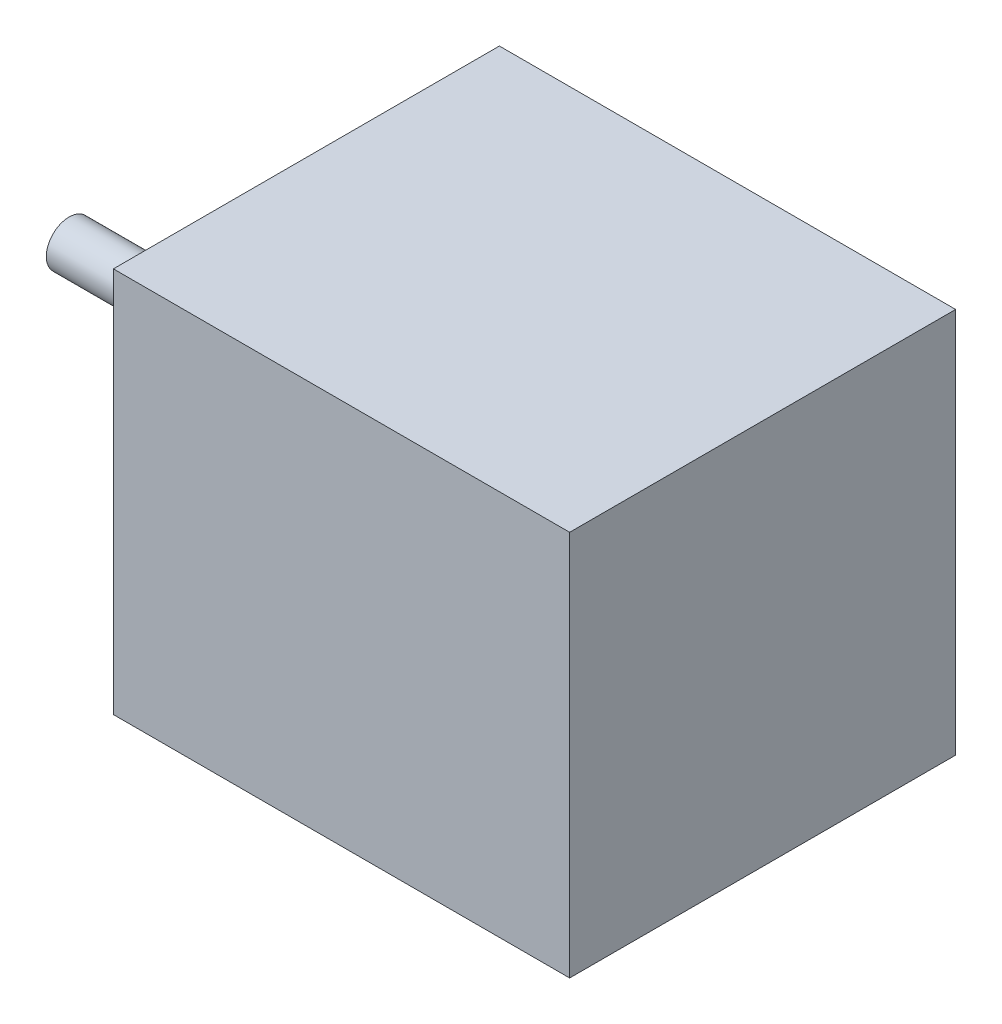
ISO-10303-21;
HEADER;
FILE_DESCRIPTION(('STEP AP214'),'2;1');
FILE_NAME('part.step','',(''),(''),'','','');
FILE_SCHEMA(('AUTOMOTIVE_DESIGN { 1 0 10303 214 1 1 1 1 }'));
ENDSEC;
DATA;
#1=APPLICATION_CONTEXT('core data for automotive mechanical design processes');
#2=APPLICATION_PROTOCOL_DEFINITION('international standard','automotive_design',2000,#1);
#3=PRODUCT_CONTEXT('',#1,'mechanical');
#4=PRODUCT('Part','Part','',(#3));
#5=PRODUCT_RELATED_PRODUCT_CATEGORY('part','',(#4));
#6=PRODUCT_DEFINITION_FORMATION('','',#4);
#7=PRODUCT_DEFINITION_CONTEXT('part definition',#1,'design');
#8=PRODUCT_DEFINITION('design','',#6,#7);
#9=PRODUCT_DEFINITION_SHAPE('','',#8);
#10=(LENGTH_UNIT() NAMED_UNIT(*) SI_UNIT(.MILLI.,.METRE.));
#11=(NAMED_UNIT(*) PLANE_ANGLE_UNIT() SI_UNIT($,.RADIAN.));
#12=(NAMED_UNIT(*) SI_UNIT($,.STERADIAN.) SOLID_ANGLE_UNIT());
#13=UNCERTAINTY_MEASURE_WITH_UNIT(LENGTH_MEASURE(1.E-05),#10,'distance_accuracy_value','');
#14=(GEOMETRIC_REPRESENTATION_CONTEXT(3) GLOBAL_UNCERTAINTY_ASSIGNED_CONTEXT((#13)) GLOBAL_UNIT_ASSIGNED_CONTEXT((#10,
#11,#12)) REPRESENTATION_CONTEXT('',''));
#15=CARTESIAN_POINT('',(0.,0.,0.));
#16=DIRECTION('',(0.,0.,1.));
#17=DIRECTION('',(1.,0.,0.));
#18=AXIS2_PLACEMENT_3D('',#15,#16,#17);
#19=CARTESIAN_POINT('',(0.,0.,0.));
#20=DIRECTION('',(1.,0.,0.));
#21=DIRECTION('',(0.,0.,-1.));
#22=AXIS2_PLACEMENT_3D('',#19,#20,#21);
#23=PLANE('',#22);
#24=CARTESIAN_POINT('',(0.,-16.5000000000001,15.5));
#25=DIRECTION('',(1.,0.,0.));
#26=DIRECTION('',(0.,0.,-1.));
#27=AXIS2_PLACEMENT_3D('',#24,#25,#26);
#28=CIRCLE('',#27,2.);
#29=CARTESIAN_POINT('',(0.,-16.5000000000001,13.5));
#30=VERTEX_POINT('',#29);
#31=EDGE_CURVE('E135',#30,#30,#28,.T.);
#32=ORIENTED_EDGE('',*,*,#31,.T.);
#33=EDGE_LOOP('',(#32));
#34=FACE_BOUND('',#33,.T.);
#35=CARTESIAN_POINT('',(0.,16.5000000000001,-15.5));
#36=DIRECTION('',(1.,0.,0.));
#37=DIRECTION('',(0.,0.,-1.));
#38=AXIS2_PLACEMENT_3D('',#35,#36,#37);
#39=CIRCLE('',#38,2.00000000000001);
#40=CARTESIAN_POINT('',(0.,16.5000000000001,-17.5));
#41=VERTEX_POINT('',#40);
#42=EDGE_CURVE('E123',#41,#41,#39,.T.);
#43=ORIENTED_EDGE('',*,*,#42,.T.);
#44=EDGE_LOOP('',(#43));
#45=FACE_BOUND('',#44,.T.);
#46=CARTESIAN_POINT('',(0.,0.,0.));
#47=DIRECTION('',(1.,0.,0.));
#48=DIRECTION('',(0.,0.,-1.));
#49=AXIS2_PLACEMENT_3D('',#46,#47,#48);
#50=CIRCLE('',#49,11.);
#51=CARTESIAN_POINT('',(0.,0.,-11.));
#52=VERTEX_POINT('',#51);
#53=EDGE_CURVE('E111',#52,#52,#50,.T.);
#54=ORIENTED_EDGE('',*,*,#53,.T.);
#55=EDGE_LOOP('',(#54));
#56=FACE_BOUND('',#55,.T.);
#57=DIRECTION('',(0.,1.,0.));
#58=VECTOR('',#57,1.);
#59=CARTESIAN_POINT('',(0.,21.15,-21.15));
#60=LINE('',#59,#58);
#61=CARTESIAN_POINT('',(0.,-21.15,-21.15));
#62=VERTEX_POINT('',#61);
#63=CARTESIAN_POINT('',(0.,21.15,-21.15));
#64=VERTEX_POINT('',#63);
#65=EDGE_CURVE('E97',#62,#64,#60,.T.);
#66=ORIENTED_EDGE('',*,*,#65,.F.);
#67=DIRECTION('',(0.,0.,-1.));
#68=VECTOR('',#67,1.);
#69=CARTESIAN_POINT('',(0.,-21.15,21.15));
#70=LINE('',#69,#68);
#71=CARTESIAN_POINT('',(0.,-21.15,21.15));
#72=VERTEX_POINT('',#71);
#73=EDGE_CURVE('E73',#72,#62,#70,.T.);
#74=ORIENTED_EDGE('',*,*,#73,.F.);
#75=DIRECTION('',(0.,-1.,0.));
#76=VECTOR('',#75,1.);
#77=CARTESIAN_POINT('',(0.,21.15,21.15));
#78=LINE('',#77,#76);
#79=CARTESIAN_POINT('',(0.,21.15,21.15));
#80=VERTEX_POINT('',#79);
#81=EDGE_CURVE('E67',#80,#72,#78,.T.);
#82=ORIENTED_EDGE('',*,*,#81,.F.);
#83=DIRECTION('',(0.,0.,1.));
#84=VECTOR('',#83,1.);
#85=CARTESIAN_POINT('',(0.,21.15,21.15));
#86=LINE('',#85,#84);
#87=EDGE_CURVE('E89',#64,#80,#86,.T.);
#88=ORIENTED_EDGE('',*,*,#87,.F.);
#89=EDGE_LOOP('',(#66,#74,#82,#88));
#90=FACE_BOUND('',#89,.T.);
#91=CARTESIAN_POINT('',(0.,-16.5000000000001,-15.5));
#92=DIRECTION('',(1.,0.,0.));
#93=DIRECTION('',(0.,0.,1.));
#94=AXIS2_PLACEMENT_3D('',#91,#92,#93);
#95=CIRCLE('',#94,2.);
#96=CARTESIAN_POINT('',(0.,-16.5000000000001,-13.5));
#97=VERTEX_POINT('',#96);
#98=EDGE_CURVE('E129',#97,#97,#95,.T.);
#99=ORIENTED_EDGE('',*,*,#98,.T.);
#100=EDGE_LOOP('',(#99));
#101=FACE_BOUND('',#100,.T.);
#102=CARTESIAN_POINT('',(0.,16.5000000000001,15.5));
#103=DIRECTION('',(1.,0.,0.));
#104=DIRECTION('',(0.,0.,1.));
#105=AXIS2_PLACEMENT_3D('',#102,#103,#104);
#106=CIRCLE('',#105,2.);
#107=CARTESIAN_POINT('',(0.,16.5000000000001,17.5));
#108=VERTEX_POINT('',#107);
#109=EDGE_CURVE('E141',#108,#108,#106,.T.);
#110=ORIENTED_EDGE('',*,*,#109,.T.);
#111=EDGE_LOOP('',(#110));
#112=FACE_BOUND('',#111,.T.);
#113=ADVANCED_FACE('F33',(#34,#45,#56,#90,#101,#112),#23,.F.);
#114=CARTESIAN_POINT('',(50.,21.15,-21.15));
#115=DIRECTION('',(0.,0.,1.));
#116=DIRECTION('',(0.,-1.,0.));
#117=AXIS2_PLACEMENT_3D('',#114,#115,#116);
#118=PLANE('',#117);
#119=ORIENTED_EDGE('',*,*,#65,.T.);
#120=DIRECTION('',(-1.,0.,0.));
#121=VECTOR('',#120,1.);
#122=CARTESIAN_POINT('',(50.,21.15,-21.15));
#123=LINE('',#122,#121);
#124=CARTESIAN_POINT('',(50.,21.15,-21.15));
#125=VERTEX_POINT('',#124);
#126=EDGE_CURVE('E11',#125,#64,#123,.T.);
#127=ORIENTED_EDGE('',*,*,#126,.F.);
#128=DIRECTION('',(0.,1.,0.));
#129=VECTOR('',#128,1.);
#130=CARTESIAN_POINT('',(50.,21.15,-21.15));
#131=LINE('',#130,#129);
#132=CARTESIAN_POINT('',(50.,-21.15,-21.15));
#133=VERTEX_POINT('',#132);
#134=EDGE_CURVE('E85',#133,#125,#131,.T.);
#135=ORIENTED_EDGE('',*,*,#134,.F.);
#136=DIRECTION('',(-1.,0.,0.));
#137=VECTOR('',#136,1.);
#138=CARTESIAN_POINT('',(50.,-21.15,-21.15));
#139=LINE('',#138,#137);
#140=EDGE_CURVE('E93',#133,#62,#139,.T.);
#141=ORIENTED_EDGE('',*,*,#140,.T.);
#142=EDGE_LOOP('',(#119,#127,#135,#141));
#143=FACE_BOUND('',#142,.T.);
#144=ADVANCED_FACE('F35',(#143),#118,.F.);
#145=CARTESIAN_POINT('',(50.,21.15,21.15));
#146=DIRECTION('',(0.,-1.,0.));
#147=DIRECTION('',(0.,0.,-1.));
#148=AXIS2_PLACEMENT_3D('',#145,#146,#147);
#149=PLANE('',#148);
#150=ORIENTED_EDGE('',*,*,#87,.T.);
#151=DIRECTION('',(-1.,0.,0.));
#152=VECTOR('',#151,1.);
#153=CARTESIAN_POINT('',(50.,21.15,21.15));
#154=LINE('',#153,#152);
#155=CARTESIAN_POINT('',(50.,21.15,21.15));
#156=VERTEX_POINT('',#155);
#157=EDGE_CURVE('E42',#156,#80,#154,.T.);
#158=ORIENTED_EDGE('',*,*,#157,.F.);
#159=DIRECTION('',(0.,0.,1.));
#160=VECTOR('',#159,1.);
#161=CARTESIAN_POINT('',(50.,21.15,21.15));
#162=LINE('',#161,#160);
#163=EDGE_CURVE('E80',#125,#156,#162,.T.);
#164=ORIENTED_EDGE('',*,*,#163,.F.);
#165=ORIENTED_EDGE('',*,*,#126,.T.);
#166=EDGE_LOOP('',(#150,#158,#164,#165));
#167=FACE_BOUND('',#166,.T.);
#168=ADVANCED_FACE('F88',(#167),#149,.F.);
#169=CARTESIAN_POINT('',(50.,21.15,21.15));
#170=DIRECTION('',(0.,0.,-1.));
#171=DIRECTION('',(0.,1.,0.));
#172=AXIS2_PLACEMENT_3D('',#169,#170,#171);
#173=PLANE('',#172);
#174=ORIENTED_EDGE('',*,*,#81,.T.);
#175=DIRECTION('',(-1.,0.,0.));
#176=VECTOR('',#175,1.);
#177=CARTESIAN_POINT('',(50.,-21.15,21.15));
#178=LINE('',#177,#176);
#179=CARTESIAN_POINT('',(50.,-21.15,21.15));
#180=VERTEX_POINT('',#179);
#181=EDGE_CURVE('E90',#180,#72,#178,.T.);
#182=ORIENTED_EDGE('',*,*,#181,.F.);
#183=DIRECTION('',(0.,-1.,0.));
#184=VECTOR('',#183,1.);
#185=CARTESIAN_POINT('',(50.,21.15,21.15));
#186=LINE('',#185,#184);
#187=EDGE_CURVE('E83',#156,#180,#186,.T.);
#188=ORIENTED_EDGE('',*,*,#187,.F.);
#189=ORIENTED_EDGE('',*,*,#157,.T.);
#190=EDGE_LOOP('',(#174,#182,#188,#189));
#191=FACE_BOUND('',#190,.T.);
#192=ADVANCED_FACE('F91',(#191),#173,.F.);
#193=CARTESIAN_POINT('',(50.,-21.15,21.15));
#194=DIRECTION('',(0.,1.,0.));
#195=DIRECTION('',(0.,0.,1.));
#196=AXIS2_PLACEMENT_3D('',#193,#194,#195);
#197=PLANE('',#196);
#198=ORIENTED_EDGE('',*,*,#73,.T.);
#199=ORIENTED_EDGE('',*,*,#140,.F.);
#200=DIRECTION('',(0.,0.,-1.));
#201=VECTOR('',#200,1.);
#202=CARTESIAN_POINT('',(50.,-21.15,21.15));
#203=LINE('',#202,#201);
#204=EDGE_CURVE('E50',#180,#133,#203,.T.);
#205=ORIENTED_EDGE('',*,*,#204,.F.);
#206=ORIENTED_EDGE('',*,*,#181,.T.);
#207=EDGE_LOOP('',(#198,#199,#205,#206));
#208=FACE_BOUND('',#207,.T.);
#209=ADVANCED_FACE('F105',(#208),#197,.F.);
#210=CARTESIAN_POINT('',(50.,0.,0.));
#211=DIRECTION('',(1.,0.,0.));
#212=DIRECTION('',(0.,0.,-1.));
#213=AXIS2_PLACEMENT_3D('',#210,#211,#212);
#214=PLANE('',#213);
#215=ORIENTED_EDGE('',*,*,#134,.T.);
#216=ORIENTED_EDGE('',*,*,#163,.T.);
#217=ORIENTED_EDGE('',*,*,#187,.T.);
#218=ORIENTED_EDGE('',*,*,#204,.T.);
#219=EDGE_LOOP('',(#215,#216,#217,#218));
#220=FACE_BOUND('',#219,.T.);
#221=ADVANCED_FACE('F81',(#220),#214,.T.);
#222=CARTESIAN_POINT('',(-2.,0.,0.));
#223=DIRECTION('',(1.,0.,0.));
#224=DIRECTION('',(0.,0.,-1.));
#225=AXIS2_PLACEMENT_3D('',#222,#223,#224);
#226=CYLINDRICAL_SURFACE('',#225,11.);
#227=CARTESIAN_POINT('',(-2.,0.,0.));
#228=DIRECTION('',(1.,0.,0.));
#229=DIRECTION('',(0.,0.,-1.));
#230=AXIS2_PLACEMENT_3D('',#227,#228,#229);
#231=CIRCLE('',#230,11.);
#232=CARTESIAN_POINT('',(-2.,0.,-11.));
#233=VERTEX_POINT('',#232);
#234=EDGE_CURVE('E100',#233,#233,#231,.T.);
#235=ORIENTED_EDGE('',*,*,#234,.T.);
#236=EDGE_LOOP('',(#235));
#237=FACE_BOUND('',#236,.T.);
#238=ORIENTED_EDGE('',*,*,#53,.F.);
#239=EDGE_LOOP('',(#238));
#240=FACE_BOUND('',#239,.T.);
#241=ADVANCED_FACE('F192',(#237,#240),#226,.T.);
#242=CARTESIAN_POINT('',(-2.,0.,0.));
#243=DIRECTION('',(1.,0.,0.));
#244=DIRECTION('',(0.,0.,-1.));
#245=AXIS2_PLACEMENT_3D('',#242,#243,#244);
#246=PLANE('',#245);
#247=CARTESIAN_POINT('',(-2.,0.,0.));
#248=DIRECTION('',(1.,0.,0.));
#249=DIRECTION('',(0.,0.,-1.));
#250=AXIS2_PLACEMENT_3D('',#247,#248,#249);
#251=CIRCLE('',#250,2.5);
#252=CARTESIAN_POINT('',(-2.,0.,-2.5));
#253=VERTEX_POINT('',#252);
#254=EDGE_CURVE('E117',#253,#253,#251,.T.);
#255=ORIENTED_EDGE('',*,*,#254,.T.);
#256=EDGE_LOOP('',(#255));
#257=FACE_BOUND('',#256,.T.);
#258=ORIENTED_EDGE('',*,*,#234,.F.);
#259=EDGE_LOOP('',(#258));
#260=FACE_BOUND('',#259,.T.);
#261=ADVANCED_FACE('F198',(#257,#260),#246,.F.);
#262=CARTESIAN_POINT('',(-26.,0.,0.));
#263=DIRECTION('',(1.,0.,0.));
#264=DIRECTION('',(0.,0.,-1.));
#265=AXIS2_PLACEMENT_3D('',#262,#263,#264);
#266=CYLINDRICAL_SURFACE('',#265,2.5);
#267=CARTESIAN_POINT('',(-26.,0.,0.));
#268=DIRECTION('',(1.,0.,0.));
#269=DIRECTION('',(0.,0.,-1.));
#270=AXIS2_PLACEMENT_3D('',#267,#268,#269);
#271=CIRCLE('',#270,2.5);
#272=CARTESIAN_POINT('',(-26.,0.,-2.5));
#273=VERTEX_POINT('',#272);
#274=EDGE_CURVE('E114',#273,#273,#271,.T.);
#275=ORIENTED_EDGE('',*,*,#274,.T.);
#276=EDGE_LOOP('',(#275));
#277=FACE_BOUND('',#276,.T.);
#278=ORIENTED_EDGE('',*,*,#254,.F.);
#279=EDGE_LOOP('',(#278));
#280=FACE_BOUND('',#279,.T.);
#281=ADVANCED_FACE('F205',(#277,#280),#266,.T.);
#282=CARTESIAN_POINT('',(-26.,0.,0.));
#283=DIRECTION('',(1.,0.,0.));
#284=DIRECTION('',(0.,0.,-1.));
#285=AXIS2_PLACEMENT_3D('',#282,#283,#284);
#286=PLANE('',#285);
#287=ORIENTED_EDGE('',*,*,#274,.F.);
#288=EDGE_LOOP('',(#287));
#289=FACE_BOUND('',#288,.T.);
#290=ADVANCED_FACE('F213',(#289),#286,.F.);
#291=CARTESIAN_POINT('',(4.5,16.5000000000001,-15.5));
#292=DIRECTION('',(-1.,0.,0.));
#293=DIRECTION('',(0.,0.,1.));
#294=AXIS2_PLACEMENT_3D('',#291,#292,#293);
#295=CYLINDRICAL_SURFACE('',#294,2.00000000000001);
#296=CARTESIAN_POINT('',(4.5,16.5000000000001,-15.5));
#297=DIRECTION('',(1.,0.,0.));
#298=DIRECTION('',(0.,0.,-1.));
#299=AXIS2_PLACEMENT_3D('',#296,#297,#298);
#300=CIRCLE('',#299,2.00000000000001);
#301=CARTESIAN_POINT('',(4.5,16.5000000000001,-17.5));
#302=VERTEX_POINT('',#301);
#303=EDGE_CURVE('E120',#302,#302,#300,.T.);
#304=ORIENTED_EDGE('',*,*,#303,.T.);
#305=EDGE_LOOP('',(#304));
#306=FACE_BOUND('',#305,.T.);
#307=ORIENTED_EDGE('',*,*,#42,.F.);
#308=EDGE_LOOP('',(#307));
#309=FACE_BOUND('',#308,.T.);
#310=ADVANCED_FACE('F219',(#306,#309),#295,.F.);
#311=CARTESIAN_POINT('',(4.5,16.5000000000001,-15.5));
#312=DIRECTION('',(1.,0.,0.));
#313=DIRECTION('',(0.,0.,-1.));
#314=AXIS2_PLACEMENT_3D('',#311,#312,#313);
#315=PLANE('',#314);
#316=ORIENTED_EDGE('',*,*,#303,.F.);
#317=EDGE_LOOP('',(#316));
#318=FACE_BOUND('',#317,.T.);
#319=ADVANCED_FACE('F232',(#318),#315,.F.);
#320=CARTESIAN_POINT('',(4.5,-16.5000000000001,-15.5));
#321=DIRECTION('',(-1.,0.,0.));
#322=DIRECTION('',(0.,0.,1.));
#323=AXIS2_PLACEMENT_3D('',#320,#321,#322);
#324=CYLINDRICAL_SURFACE('',#323,2.);
#325=CARTESIAN_POINT('',(4.5,-16.5000000000001,-15.5));
#326=DIRECTION('',(1.,0.,0.));
#327=DIRECTION('',(0.,0.,1.));
#328=AXIS2_PLACEMENT_3D('',#325,#326,#327);
#329=CIRCLE('',#328,2.);
#330=CARTESIAN_POINT('',(4.5,-16.5000000000001,-13.5));
#331=VERTEX_POINT('',#330);
#332=EDGE_CURVE('E126',#331,#331,#329,.T.);
#333=ORIENTED_EDGE('',*,*,#332,.T.);
#334=EDGE_LOOP('',(#333));
#335=FACE_BOUND('',#334,.T.);
#336=ORIENTED_EDGE('',*,*,#98,.F.);
#337=EDGE_LOOP('',(#336));
#338=FACE_BOUND('',#337,.T.);
#339=ADVANCED_FACE('F239',(#335,#338),#324,.F.);
#340=CARTESIAN_POINT('',(4.5,-16.5000000000001,-15.5));
#341=DIRECTION('',(-1.,0.,0.));
#342=DIRECTION('',(0.,0.,1.));
#343=AXIS2_PLACEMENT_3D('',#340,#341,#342);
#344=PLANE('',#343);
#345=ORIENTED_EDGE('',*,*,#332,.F.);
#346=EDGE_LOOP('',(#345));
#347=FACE_BOUND('',#346,.T.);
#348=ADVANCED_FACE('F247',(#347),#344,.T.);
#349=CARTESIAN_POINT('',(4.5,-16.5000000000001,15.5));
#350=DIRECTION('',(-1.,0.,0.));
#351=DIRECTION('',(0.,0.,1.));
#352=AXIS2_PLACEMENT_3D('',#349,#350,#351);
#353=CYLINDRICAL_SURFACE('',#352,2.);
#354=CARTESIAN_POINT('',(4.5,-16.5000000000001,15.5));
#355=DIRECTION('',(1.,0.,0.));
#356=DIRECTION('',(0.,0.,-1.));
#357=AXIS2_PLACEMENT_3D('',#354,#355,#356);
#358=CIRCLE('',#357,2.);
#359=CARTESIAN_POINT('',(4.5,-16.5000000000001,13.5));
#360=VERTEX_POINT('',#359);
#361=EDGE_CURVE('E132',#360,#360,#358,.T.);
#362=ORIENTED_EDGE('',*,*,#361,.T.);
#363=EDGE_LOOP('',(#362));
#364=FACE_BOUND('',#363,.T.);
#365=ORIENTED_EDGE('',*,*,#31,.F.);
#366=EDGE_LOOP('',(#365));
#367=FACE_BOUND('',#366,.T.);
#368=ADVANCED_FACE('F255',(#364,#367),#353,.F.);
#369=CARTESIAN_POINT('',(4.5,-16.5000000000001,15.5));
#370=DIRECTION('',(1.,0.,0.));
#371=DIRECTION('',(0.,0.,-1.));
#372=AXIS2_PLACEMENT_3D('',#369,#370,#371);
#373=PLANE('',#372);
#374=ORIENTED_EDGE('',*,*,#361,.F.);
#375=EDGE_LOOP('',(#374));
#376=FACE_BOUND('',#375,.T.);
#377=ADVANCED_FACE('F156',(#376),#373,.F.);
#378=CARTESIAN_POINT('',(4.5,16.5000000000001,15.5));
#379=DIRECTION('',(-1.,0.,0.));
#380=DIRECTION('',(0.,0.,1.));
#381=AXIS2_PLACEMENT_3D('',#378,#379,#380);
#382=CYLINDRICAL_SURFACE('',#381,2.);
#383=CARTESIAN_POINT('',(4.5,16.5000000000001,15.5));
#384=DIRECTION('',(1.,0.,0.));
#385=DIRECTION('',(0.,0.,1.));
#386=AXIS2_PLACEMENT_3D('',#383,#384,#385);
#387=CIRCLE('',#386,2.);
#388=CARTESIAN_POINT('',(4.5,16.5000000000001,17.5));
#389=VERTEX_POINT('',#388);
#390=EDGE_CURVE('E138',#389,#389,#387,.T.);
#391=ORIENTED_EDGE('',*,*,#390,.T.);
#392=EDGE_LOOP('',(#391));
#393=FACE_BOUND('',#392,.T.);
#394=ORIENTED_EDGE('',*,*,#109,.F.);
#395=EDGE_LOOP('',(#394));
#396=FACE_BOUND('',#395,.T.);
#397=ADVANCED_FACE('F147',(#393,#396),#382,.F.);
#398=CARTESIAN_POINT('',(4.5,16.5000000000001,15.5));
#399=DIRECTION('',(-1.,0.,0.));
#400=DIRECTION('',(0.,0.,1.));
#401=AXIS2_PLACEMENT_3D('',#398,#399,#400);
#402=PLANE('',#401);
#403=ORIENTED_EDGE('',*,*,#390,.F.);
#404=EDGE_LOOP('',(#403));
#405=FACE_BOUND('',#404,.T.);
#406=ADVANCED_FACE('F150',(#405),#402,.T.);
#407=CLOSED_SHELL('',(#113,#144,#168,#192,#209,#221,#241,#261,#281,#290,#310,#319,#339,#348,
#368,#377,#397,#406));
#408=MANIFOLD_SOLID_BREP('B2',#407);
#409=ADVANCED_BREP_SHAPE_REPRESENTATION('',(#18,#408),#14);
#410=SHAPE_DEFINITION_REPRESENTATION(#9,#409);
ENDSEC;
END-ISO-10303-21;
